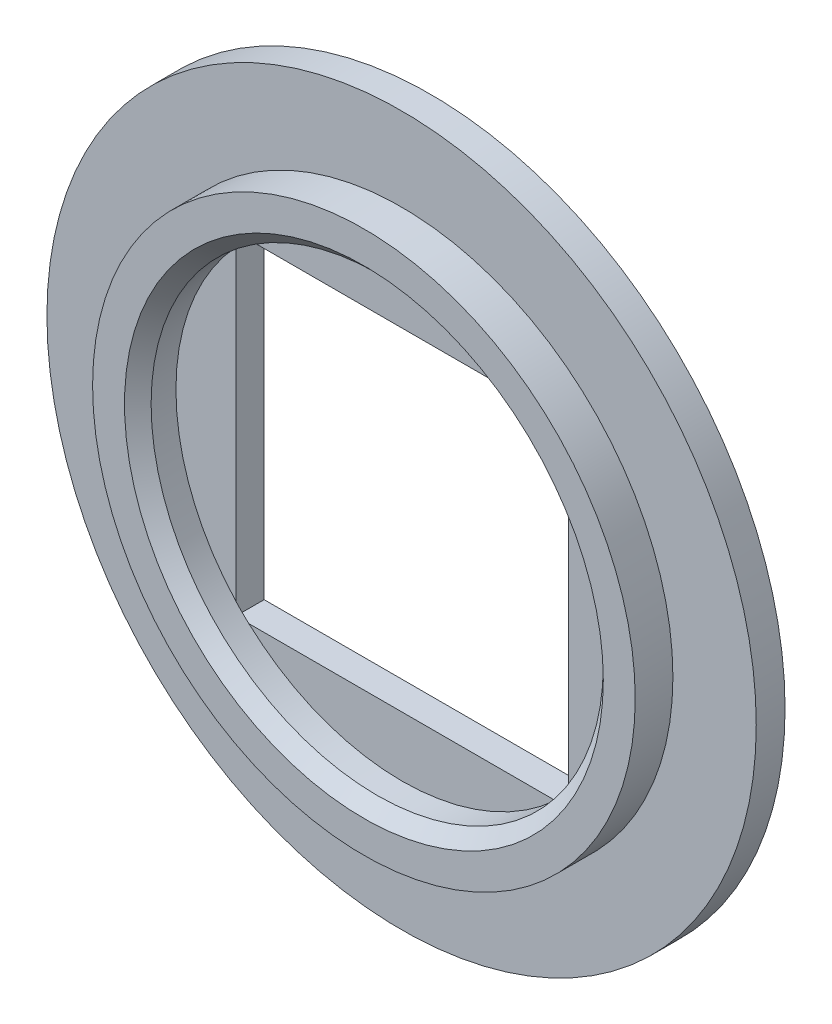
ISO-10303-21;
HEADER;
FILE_DESCRIPTION(('STEP AP214'),'2;1');
FILE_NAME('part.step','',(''),(''),'','','');
FILE_SCHEMA(('AUTOMOTIVE_DESIGN { 1 0 10303 214 1 1 1 1 }'));
ENDSEC;
DATA;
#1=APPLICATION_CONTEXT('core data for automotive mechanical design processes');
#2=APPLICATION_PROTOCOL_DEFINITION('international standard','automotive_design',2000,#1);
#3=PRODUCT_CONTEXT('',#1,'mechanical');
#4=PRODUCT('Part','Part','',(#3));
#5=PRODUCT_RELATED_PRODUCT_CATEGORY('part','',(#4));
#6=PRODUCT_DEFINITION_FORMATION('','',#4);
#7=PRODUCT_DEFINITION_CONTEXT('part definition',#1,'design');
#8=PRODUCT_DEFINITION('design','',#6,#7);
#9=PRODUCT_DEFINITION_SHAPE('','',#8);
#10=(LENGTH_UNIT() NAMED_UNIT(*) SI_UNIT(.MILLI.,.METRE.));
#11=(NAMED_UNIT(*) PLANE_ANGLE_UNIT() SI_UNIT($,.RADIAN.));
#12=(NAMED_UNIT(*) SI_UNIT($,.STERADIAN.) SOLID_ANGLE_UNIT());
#13=UNCERTAINTY_MEASURE_WITH_UNIT(LENGTH_MEASURE(1.E-05),#10,'distance_accuracy_value','');
#14=(GEOMETRIC_REPRESENTATION_CONTEXT(3) GLOBAL_UNCERTAINTY_ASSIGNED_CONTEXT((#13)) GLOBAL_UNIT_ASSIGNED_CONTEXT((#10,
#11,#12)) REPRESENTATION_CONTEXT('',''));
#15=CARTESIAN_POINT('',(0.,0.,0.));
#16=DIRECTION('',(0.,0.,1.));
#17=DIRECTION('',(1.,0.,0.));
#18=AXIS2_PLACEMENT_3D('',#15,#16,#17);
#19=CARTESIAN_POINT('',(0.,0.,0.64));
#20=DIRECTION('',(0.,0.,1.));
#21=DIRECTION('',(1.,0.,0.));
#22=AXIS2_PLACEMENT_3D('',#19,#20,#21);
#23=PLANE('',#22);
#24=DIRECTION('',(0.,-1.,0.));
#25=VECTOR('',#24,1.);
#26=CARTESIAN_POINT('',(-3.75,0.,0.64));
#27=LINE('',#26,#25);
#28=CARTESIAN_POINT('',(-3.75,3.45651558654087,0.64));
#29=VERTEX_POINT('',#28);
#30=CARTESIAN_POINT('',(-3.75,-3.45651558654087,0.64));
#31=VERTEX_POINT('',#30);
#32=EDGE_CURVE('E142',#29,#31,#27,.T.);
#33=ORIENTED_EDGE('',*,*,#32,.F.);
#34=CARTESIAN_POINT('',(0.,0.,0.64));
#35=DIRECTION('',(0.,0.,1.));
#36=DIRECTION('',(1.,0.,0.));
#37=AXIS2_PLACEMENT_3D('',#34,#35,#36);
#38=CIRCLE('',#37,5.1);
#39=EDGE_CURVE('E214',#29,#31,#38,.T.);
#40=ORIENTED_EDGE('',*,*,#39,.T.);
#41=EDGE_LOOP('',(#33,#40));
#42=FACE_BOUND('',#41,.T.);
#43=ADVANCED_FACE('F45',(#42),#23,.T.);
#44=DIRECTION('',(1.,0.,0.));
#45=VECTOR('',#44,1.);
#46=CARTESIAN_POINT('',(3.75,-3.75,0.64));
#47=LINE('',#46,#45);
#48=CARTESIAN_POINT('',(-3.45651558654087,-3.75,0.64));
#49=VERTEX_POINT('',#48);
#50=CARTESIAN_POINT('',(3.45651558654087,-3.75,0.64));
#51=VERTEX_POINT('',#50);
#52=EDGE_CURVE('E149',#49,#51,#47,.T.);
#53=ORIENTED_EDGE('',*,*,#52,.F.);
#54=EDGE_CURVE('E204',#49,#51,#38,.T.);
#55=ORIENTED_EDGE('',*,*,#54,.T.);
#56=EDGE_LOOP('',(#53,#55));
#57=FACE_BOUND('',#56,.T.);
#58=ADVANCED_FACE('F209',(#57),#23,.T.);
#59=DIRECTION('',(0.,1.,0.));
#60=VECTOR('',#59,1.);
#61=CARTESIAN_POINT('',(3.75,3.75,0.64));
#62=LINE('',#61,#60);
#63=CARTESIAN_POINT('',(3.75,-3.45651558654087,0.64));
#64=VERTEX_POINT('',#63);
#65=CARTESIAN_POINT('',(3.75,3.45651558654087,0.64));
#66=VERTEX_POINT('',#65);
#67=EDGE_CURVE('E178',#64,#66,#62,.T.);
#68=ORIENTED_EDGE('',*,*,#67,.F.);
#69=EDGE_CURVE('E176',#64,#66,#38,.T.);
#70=ORIENTED_EDGE('',*,*,#69,.T.);
#71=EDGE_LOOP('',(#68,#70));
#72=FACE_BOUND('',#71,.T.);
#73=ADVANCED_FACE('F253',(#72),#23,.T.);
#74=CARTESIAN_POINT('',(0.,0.,0.));
#75=DIRECTION('',(0.,0.,1.));
#76=DIRECTION('',(1.,0.,0.));
#77=AXIS2_PLACEMENT_3D('',#74,#75,#76);
#78=PLANE('',#77);
#79=CARTESIAN_POINT('',(0.,0.,0.));
#80=DIRECTION('',(0.,0.,1.));
#81=DIRECTION('',(1.,0.,0.));
#82=AXIS2_PLACEMENT_3D('',#79,#80,#81);
#83=CIRCLE('',#82,8.);
#84=CARTESIAN_POINT('',(8.,0.,0.));
#85=VERTEX_POINT('',#84);
#86=EDGE_CURVE('E223',#85,#85,#83,.T.);
#87=ORIENTED_EDGE('',*,*,#86,.F.);
#88=EDGE_LOOP('',(#87));
#89=FACE_BOUND('',#88,.T.);
#90=DIRECTION('',(1.,0.,0.));
#91=VECTOR('',#90,1.);
#92=CARTESIAN_POINT('',(3.75,-3.75,0.));
#93=LINE('',#92,#91);
#94=CARTESIAN_POINT('',(-3.75,-3.75,0.));
#95=VERTEX_POINT('',#94);
#96=CARTESIAN_POINT('',(3.75,-3.75,0.));
#97=VERTEX_POINT('',#96);
#98=EDGE_CURVE('E70',#95,#97,#93,.T.);
#99=ORIENTED_EDGE('',*,*,#98,.T.);
#100=DIRECTION('',(0.,1.,0.));
#101=VECTOR('',#100,1.);
#102=CARTESIAN_POINT('',(3.75,3.75,0.));
#103=LINE('',#102,#101);
#104=CARTESIAN_POINT('',(3.75,3.75,0.));
#105=VERTEX_POINT('',#104);
#106=EDGE_CURVE('E168',#97,#105,#103,.T.);
#107=ORIENTED_EDGE('',*,*,#106,.T.);
#108=DIRECTION('',(-1.,0.,0.));
#109=VECTOR('',#108,1.);
#110=CARTESIAN_POINT('',(-3.75,3.75,0.));
#111=LINE('',#110,#109);
#112=CARTESIAN_POINT('',(-3.75,3.75,0.));
#113=VERTEX_POINT('',#112);
#114=EDGE_CURVE('E136',#105,#113,#111,.T.);
#115=ORIENTED_EDGE('',*,*,#114,.T.);
#116=DIRECTION('',(0.,-1.,0.));
#117=VECTOR('',#116,1.);
#118=CARTESIAN_POINT('',(-3.75,0.,0.));
#119=LINE('',#118,#117);
#120=EDGE_CURVE('E133',#113,#95,#119,.T.);
#121=ORIENTED_EDGE('',*,*,#120,.T.);
#122=EDGE_LOOP('',(#99,#107,#115,#121));
#123=FACE_BOUND('',#122,.T.);
#124=ADVANCED_FACE('F264',(#89,#123),#78,.F.);
#125=CARTESIAN_POINT('',(0.,0.,0.65));
#126=DIRECTION('',(0.,0.,-1.));
#127=DIRECTION('',(-1.,0.,0.));
#128=AXIS2_PLACEMENT_3D('',#125,#126,#127);
#129=CYLINDRICAL_SURFACE('',#128,8.);
#130=CARTESIAN_POINT('',(0.,0.,0.65));
#131=DIRECTION('',(0.,0.,1.));
#132=DIRECTION('',(1.,0.,0.));
#133=AXIS2_PLACEMENT_3D('',#130,#131,#132);
#134=CIRCLE('',#133,8.);
#135=CARTESIAN_POINT('',(8.,0.,0.65));
#136=VERTEX_POINT('',#135);
#137=EDGE_CURVE('E226',#136,#136,#134,.T.);
#138=ORIENTED_EDGE('',*,*,#137,.F.);
#139=EDGE_LOOP('',(#138));
#140=FACE_BOUND('',#139,.T.);
#141=ORIENTED_EDGE('',*,*,#86,.T.);
#142=EDGE_LOOP('',(#141));
#143=FACE_BOUND('',#142,.T.);
#144=ADVANCED_FACE('F269',(#140,#143),#129,.T.);
#145=CARTESIAN_POINT('',(0.,0.,0.65));
#146=DIRECTION('',(0.,0.,1.));
#147=DIRECTION('',(1.,0.,0.));
#148=AXIS2_PLACEMENT_3D('',#145,#146,#147);
#149=PLANE('',#148);
#150=CARTESIAN_POINT('',(0.,0.,0.65));
#151=DIRECTION('',(0.,0.,1.));
#152=DIRECTION('',(1.,0.,0.));
#153=AXIS2_PLACEMENT_3D('',#150,#151,#152);
#154=CIRCLE('',#153,6.12);
#155=CARTESIAN_POINT('',(6.12,0.,0.65));
#156=VERTEX_POINT('',#155);
#157=EDGE_CURVE('E217',#156,#156,#154,.T.);
#158=ORIENTED_EDGE('',*,*,#157,.F.);
#159=EDGE_LOOP('',(#158));
#160=FACE_BOUND('',#159,.T.);
#161=ORIENTED_EDGE('',*,*,#137,.T.);
#162=EDGE_LOOP('',(#161));
#163=FACE_BOUND('',#162,.T.);
#164=ADVANCED_FACE('F357',(#160,#163),#149,.T.);
#165=CARTESIAN_POINT('',(0.,0.,1.5));
#166=DIRECTION('',(0.,0.,1.));
#167=DIRECTION('',(1.,0.,0.));
#168=AXIS2_PLACEMENT_3D('',#165,#166,#167);
#169=PLANE('',#168);
#170=CARTESIAN_POINT('',(0.,0.,1.5));
#171=DIRECTION('',(0.,0.,1.));
#172=DIRECTION('',(1.,0.,0.));
#173=AXIS2_PLACEMENT_3D('',#170,#171,#172);
#174=CIRCLE('',#173,5.40000000000001);
#175=CARTESIAN_POINT('',(5.40000000000001,0.,1.5));
#176=VERTEX_POINT('',#175);
#177=EDGE_CURVE('E11',#176,#176,#174,.F.);
#178=ORIENTED_EDGE('',*,*,#177,.T.);
#179=EDGE_LOOP('',(#178));
#180=FACE_BOUND('',#179,.T.);
#181=CARTESIAN_POINT('',(0.,0.,1.5));
#182=DIRECTION('',(0.,0.,1.));
#183=DIRECTION('',(1.,0.,0.));
#184=AXIS2_PLACEMENT_3D('',#181,#182,#183);
#185=CIRCLE('',#184,6.12);
#186=CARTESIAN_POINT('',(6.12,0.,1.5));
#187=VERTEX_POINT('',#186);
#188=EDGE_CURVE('E220',#187,#187,#185,.T.);
#189=ORIENTED_EDGE('',*,*,#188,.T.);
#190=EDGE_LOOP('',(#189));
#191=FACE_BOUND('',#190,.T.);
#192=ADVANCED_FACE('F352',(#180,#191),#169,.T.);
#193=CARTESIAN_POINT('',(0.,0.,1.5));
#194=DIRECTION('',(0.,0.,-1.));
#195=DIRECTION('',(-1.,0.,0.));
#196=AXIS2_PLACEMENT_3D('',#193,#194,#195);
#197=CYLINDRICAL_SURFACE('',#196,6.12);
#198=ORIENTED_EDGE('',*,*,#188,.F.);
#199=EDGE_LOOP('',(#198));
#200=FACE_BOUND('',#199,.T.);
#201=ORIENTED_EDGE('',*,*,#157,.T.);
#202=EDGE_LOOP('',(#201));
#203=FACE_BOUND('',#202,.T.);
#204=ADVANCED_FACE('F262',(#200,#203),#197,.T.);
#205=CARTESIAN_POINT('',(0.,0.,1.5));
#206=DIRECTION('',(0.,0.,-1.));
#207=DIRECTION('',(-1.,0.,0.));
#208=AXIS2_PLACEMENT_3D('',#205,#206,#207);
#209=CYLINDRICAL_SURFACE('',#208,5.1);
#210=CARTESIAN_POINT('',(0.,0.,1.2));
#211=DIRECTION('',(0.,0.,1.));
#212=DIRECTION('',(1.,0.,0.));
#213=AXIS2_PLACEMENT_3D('',#210,#211,#212);
#214=CIRCLE('',#213,5.1);
#215=CARTESIAN_POINT('',(5.1,0.,1.2));
#216=VERTEX_POINT('',#215);
#217=EDGE_CURVE('E55',#216,#216,#214,.T.);
#218=ORIENTED_EDGE('',*,*,#217,.T.);
#219=EDGE_LOOP('',(#218));
#220=FACE_BOUND('',#219,.T.);
#221=CARTESIAN_POINT('',(3.45651558654087,3.75,0.64));
#222=VERTEX_POINT('',#221);
#223=EDGE_CURVE('E215',#66,#222,#38,.T.);
#224=ORIENTED_EDGE('',*,*,#223,.F.);
#225=ORIENTED_EDGE('',*,*,#69,.F.);
#226=EDGE_CURVE('E200',#51,#64,#38,.T.);
#227=ORIENTED_EDGE('',*,*,#226,.F.);
#228=ORIENTED_EDGE('',*,*,#54,.F.);
#229=EDGE_CURVE('E211',#31,#49,#38,.T.);
#230=ORIENTED_EDGE('',*,*,#229,.F.);
#231=ORIENTED_EDGE('',*,*,#39,.F.);
#232=CARTESIAN_POINT('',(-3.45651558654087,3.75,0.64));
#233=VERTEX_POINT('',#232);
#234=EDGE_CURVE('E139',#233,#29,#38,.T.);
#235=ORIENTED_EDGE('',*,*,#234,.F.);
#236=EDGE_CURVE('E218',#222,#233,#38,.T.);
#237=ORIENTED_EDGE('',*,*,#236,.F.);
#238=EDGE_LOOP('',(#224,#225,#227,#228,#230,#231,#235,#237));
#239=FACE_BOUND('',#238,.T.);
#240=ADVANCED_FACE('F202',(#220,#239),#209,.F.);
#241=DIRECTION('',(-1.,0.,0.));
#242=VECTOR('',#241,1.);
#243=CARTESIAN_POINT('',(-3.75,3.75,0.64));
#244=LINE('',#243,#242);
#245=EDGE_CURVE('E119',#222,#233,#244,.T.);
#246=ORIENTED_EDGE('',*,*,#245,.F.);
#247=ORIENTED_EDGE('',*,*,#236,.T.);
#248=EDGE_LOOP('',(#246,#247));
#249=FACE_BOUND('',#248,.T.);
#250=ADVANCED_FACE('F249',(#249),#23,.T.);
#251=CARTESIAN_POINT('',(0.,0.,0.64));
#252=DIRECTION('',(0.,0.,1.));
#253=DIRECTION('',(1.,0.,0.));
#254=AXIS2_PLACEMENT_3D('',#251,#252,#253);
#255=PLANE('',#254);
#256=ORIENTED_EDGE('',*,*,#223,.T.);
#257=CARTESIAN_POINT('',(3.75,3.75,0.64));
#258=VERTEX_POINT('',#257);
#259=EDGE_CURVE('E62',#258,#222,#244,.T.);
#260=ORIENTED_EDGE('',*,*,#259,.F.);
#261=EDGE_CURVE('E179',#66,#258,#62,.T.);
#262=ORIENTED_EDGE('',*,*,#261,.F.);
#263=EDGE_LOOP('',(#256,#260,#262));
#264=FACE_BOUND('',#263,.T.);
#265=ADVANCED_FACE('F243',(#264),#255,.F.);
#266=ORIENTED_EDGE('',*,*,#234,.T.);
#267=CARTESIAN_POINT('',(-3.75,3.75,0.64));
#268=VERTEX_POINT('',#267);
#269=EDGE_CURVE('E130',#268,#29,#27,.T.);
#270=ORIENTED_EDGE('',*,*,#269,.F.);
#271=EDGE_CURVE('E112',#233,#268,#244,.T.);
#272=ORIENTED_EDGE('',*,*,#271,.F.);
#273=EDGE_LOOP('',(#266,#270,#272));
#274=FACE_BOUND('',#273,.T.);
#275=ADVANCED_FACE('F138',(#274),#255,.F.);
#276=ORIENTED_EDGE('',*,*,#229,.T.);
#277=CARTESIAN_POINT('',(-3.75,-3.75,0.64));
#278=VERTEX_POINT('',#277);
#279=EDGE_CURVE('E151',#278,#49,#47,.T.);
#280=ORIENTED_EDGE('',*,*,#279,.F.);
#281=EDGE_CURVE('E144',#31,#278,#27,.T.);
#282=ORIENTED_EDGE('',*,*,#281,.F.);
#283=EDGE_LOOP('',(#276,#280,#282));
#284=FACE_BOUND('',#283,.T.);
#285=ADVANCED_FACE('F244',(#284),#255,.F.);
#286=CARTESIAN_POINT('',(3.75,-3.75,11.2466017177982));
#287=DIRECTION('',(0.,1.,0.));
#288=DIRECTION('',(-1.,0.,0.));
#289=AXIS2_PLACEMENT_3D('',#286,#287,#288);
#290=PLANE('',#289);
#291=ORIENTED_EDGE('',*,*,#279,.T.);
#292=ORIENTED_EDGE('',*,*,#52,.T.);
#293=CARTESIAN_POINT('',(3.75,-3.75,0.64));
#294=VERTEX_POINT('',#293);
#295=EDGE_CURVE('E141',#51,#294,#47,.T.);
#296=ORIENTED_EDGE('',*,*,#295,.T.);
#297=DIRECTION('',(0.,0.,-1.));
#298=VECTOR('',#297,1.);
#299=CARTESIAN_POINT('',(3.75,-3.75,11.2466017177982));
#300=LINE('',#299,#298);
#301=EDGE_CURVE('E171',#294,#97,#300,.T.);
#302=ORIENTED_EDGE('',*,*,#301,.T.);
#303=ORIENTED_EDGE('',*,*,#98,.F.);
#304=DIRECTION('',(0.,0.,-1.));
#305=VECTOR('',#304,1.);
#306=CARTESIAN_POINT('',(-3.75,-3.75,11.2466017177982));
#307=LINE('',#306,#305);
#308=EDGE_CURVE('E173',#278,#95,#307,.T.);
#309=ORIENTED_EDGE('',*,*,#308,.F.);
#310=EDGE_LOOP('',(#291,#292,#296,#302,#303,#309));
#311=FACE_BOUND('',#310,.T.);
#312=ADVANCED_FACE('F193',(#311),#290,.T.);
#313=CARTESIAN_POINT('',(3.75,3.75,11.2466017177982));
#314=DIRECTION('',(-1.,0.,0.));
#315=DIRECTION('',(0.,-1.,0.));
#316=AXIS2_PLACEMENT_3D('',#313,#314,#315);
#317=PLANE('',#316);
#318=EDGE_CURVE('E124',#294,#64,#62,.T.);
#319=ORIENTED_EDGE('',*,*,#318,.T.);
#320=ORIENTED_EDGE('',*,*,#67,.T.);
#321=ORIENTED_EDGE('',*,*,#261,.T.);
#322=DIRECTION('',(0.,0.,-1.));
#323=VECTOR('',#322,1.);
#324=CARTESIAN_POINT('',(3.75,3.75,11.2466017177982));
#325=LINE('',#324,#323);
#326=EDGE_CURVE('E167',#258,#105,#325,.T.);
#327=ORIENTED_EDGE('',*,*,#326,.T.);
#328=ORIENTED_EDGE('',*,*,#106,.F.);
#329=ORIENTED_EDGE('',*,*,#301,.F.);
#330=EDGE_LOOP('',(#319,#320,#321,#327,#328,#329));
#331=FACE_BOUND('',#330,.T.);
#332=ADVANCED_FACE('F314',(#331),#317,.T.);
#333=CARTESIAN_POINT('',(-3.75,3.75,11.2466017177982));
#334=DIRECTION('',(0.,-1.,0.));
#335=DIRECTION('',(0.,0.,-1.));
#336=AXIS2_PLACEMENT_3D('',#333,#334,#335);
#337=PLANE('',#336);
#338=ORIENTED_EDGE('',*,*,#259,.T.);
#339=ORIENTED_EDGE('',*,*,#245,.T.);
#340=ORIENTED_EDGE('',*,*,#271,.T.);
#341=DIRECTION('',(0.,0.,-1.));
#342=VECTOR('',#341,1.);
#343=CARTESIAN_POINT('',(-3.75,3.75,11.2466017177982));
#344=LINE('',#343,#342);
#345=EDGE_CURVE('E116',#268,#113,#344,.T.);
#346=ORIENTED_EDGE('',*,*,#345,.T.);
#347=ORIENTED_EDGE('',*,*,#114,.F.);
#348=ORIENTED_EDGE('',*,*,#326,.F.);
#349=EDGE_LOOP('',(#338,#339,#340,#346,#347,#348));
#350=FACE_BOUND('',#349,.T.);
#351=ADVANCED_FACE('F114',(#350),#337,.T.);
#352=CARTESIAN_POINT('',(-3.75,0.,11.2466017177982));
#353=DIRECTION('',(1.,0.,0.));
#354=DIRECTION('',(0.,0.,-1.));
#355=AXIS2_PLACEMENT_3D('',#352,#353,#354);
#356=PLANE('',#355);
#357=ORIENTED_EDGE('',*,*,#269,.T.);
#358=ORIENTED_EDGE('',*,*,#32,.T.);
#359=ORIENTED_EDGE('',*,*,#281,.T.);
#360=ORIENTED_EDGE('',*,*,#308,.T.);
#361=ORIENTED_EDGE('',*,*,#120,.F.);
#362=ORIENTED_EDGE('',*,*,#345,.F.);
#363=EDGE_LOOP('',(#357,#358,#359,#360,#361,#362));
#364=FACE_BOUND('',#363,.T.);
#365=ADVANCED_FACE('F128',(#364),#356,.T.);
#366=ORIENTED_EDGE('',*,*,#226,.T.);
#367=ORIENTED_EDGE('',*,*,#318,.F.);
#368=ORIENTED_EDGE('',*,*,#295,.F.);
#369=EDGE_LOOP('',(#366,#367,#368));
#370=FACE_BOUND('',#369,.T.);
#371=ADVANCED_FACE('F237',(#370),#255,.F.);
#372=CARTESIAN_POINT('',(0.,0.,1.2));
#373=DIRECTION('',(0.,0.,1.));
#374=DIRECTION('',(1.,0.,0.));
#375=AXIS2_PLACEMENT_3D('',#372,#373,#374);
#376=CONICAL_SURFACE('',#375,5.1,0.785398163397457);
#377=ORIENTED_EDGE('',*,*,#177,.F.);
#378=EDGE_LOOP('',(#377));
#379=FACE_BOUND('',#378,.T.);
#380=ORIENTED_EDGE('',*,*,#217,.F.);
#381=EDGE_LOOP('',(#380));
#382=FACE_BOUND('',#381,.T.);
#383=ADVANCED_FACE('F48',(#379,#382),#376,.F.);
#384=CLOSED_SHELL('',(#43,#58,#73,#124,#144,#164,#192,#204,#240,#250,#265,#275,#285,#312,#332,
#351,#365,#371,#383));
#385=MANIFOLD_SOLID_BREP('B2',#384);
#386=ADVANCED_BREP_SHAPE_REPRESENTATION('',(#18,#385),#14);
#387=SHAPE_DEFINITION_REPRESENTATION(#9,#386);
ENDSEC;
END-ISO-10303-21;
